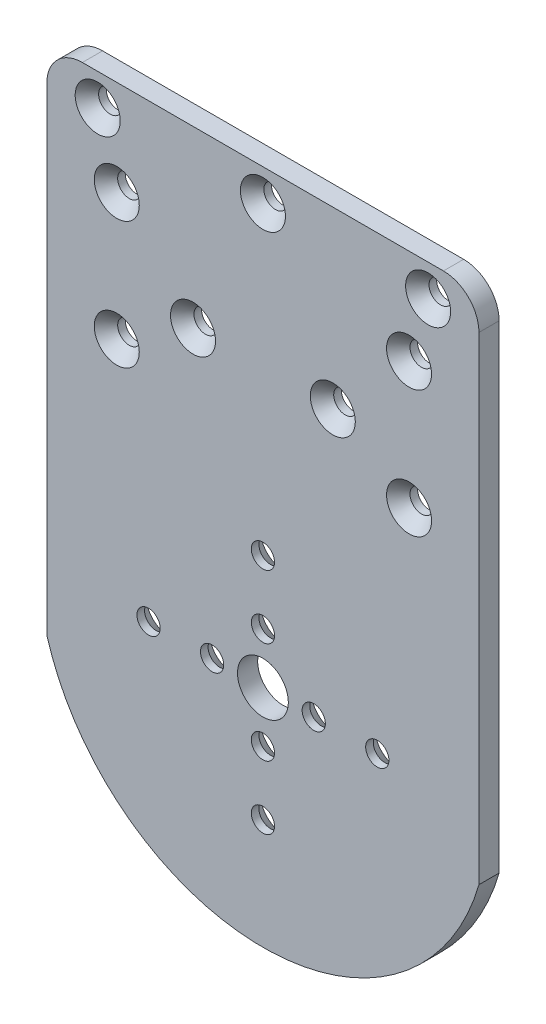
ISO-10303-21;
HEADER;
FILE_DESCRIPTION(('STEP AP214'),'2;1');
FILE_NAME('part.step','',(''),(''),'','','');
FILE_SCHEMA(('AUTOMOTIVE_DESIGN { 1 0 10303 214 1 1 1 1 }'));
ENDSEC;
DATA;
#1=APPLICATION_CONTEXT('core data for automotive mechanical design processes');
#2=APPLICATION_PROTOCOL_DEFINITION('international standard','automotive_design',2000,#1);
#3=PRODUCT_CONTEXT('',#1,'mechanical');
#4=PRODUCT('Part','Part','',(#3));
#5=PRODUCT_RELATED_PRODUCT_CATEGORY('part','',(#4));
#6=PRODUCT_DEFINITION_FORMATION('','',#4);
#7=PRODUCT_DEFINITION_CONTEXT('part definition',#1,'design');
#8=PRODUCT_DEFINITION('design','',#6,#7);
#9=PRODUCT_DEFINITION_SHAPE('','',#8);
#10=(LENGTH_UNIT() NAMED_UNIT(*) SI_UNIT(.MILLI.,.METRE.));
#11=(NAMED_UNIT(*) PLANE_ANGLE_UNIT() SI_UNIT($,.RADIAN.));
#12=(NAMED_UNIT(*) SI_UNIT($,.STERADIAN.) SOLID_ANGLE_UNIT());
#13=UNCERTAINTY_MEASURE_WITH_UNIT(LENGTH_MEASURE(1.E-05),#10,'distance_accuracy_value','');
#14=(GEOMETRIC_REPRESENTATION_CONTEXT(3) GLOBAL_UNCERTAINTY_ASSIGNED_CONTEXT((#13)) GLOBAL_UNIT_ASSIGNED_CONTEXT((#10,
#11,#12)) REPRESENTATION_CONTEXT('',''));
#15=CARTESIAN_POINT('',(0.,0.,0.));
#16=DIRECTION('',(0.,0.,1.));
#17=DIRECTION('',(1.,0.,0.));
#18=AXIS2_PLACEMENT_3D('',#15,#16,#17);
#19=CARTESIAN_POINT('',(0.,0.,3.175));
#20=DIRECTION('',(0.,0.,1.));
#21=DIRECTION('',(1.,0.,0.));
#22=AXIS2_PLACEMENT_3D('',#19,#20,#21);
#23=PLANE('',#22);
#24=CARTESIAN_POINT('',(23.,36.,3.175));
#25=DIRECTION('',(0.,0.,1.));
#26=DIRECTION('',(1.,0.,0.));
#27=AXIS2_PLACEMENT_3D('',#24,#25,#26);
#28=CIRCLE('',#27,3.5433);
#29=CARTESIAN_POINT('',(26.5433,36.,3.175));
#30=VERTEX_POINT('',#29);
#31=EDGE_CURVE('E304',#30,#30,#28,.T.);
#32=ORIENTED_EDGE('',*,*,#31,.F.);
#33=EDGE_LOOP('',(#32));
#34=FACE_BOUND('',#33,.T.);
#35=CARTESIAN_POINT('',(23.,56.,3.175));
#36=DIRECTION('',(0.,0.,1.));
#37=DIRECTION('',(1.,0.,0.));
#38=AXIS2_PLACEMENT_3D('',#35,#36,#37);
#39=CIRCLE('',#38,3.5433);
#40=CARTESIAN_POINT('',(26.5433,56.,3.175));
#41=VERTEX_POINT('',#40);
#42=EDGE_CURVE('E295',#41,#41,#39,.T.);
#43=ORIENTED_EDGE('',*,*,#42,.F.);
#44=EDGE_LOOP('',(#43));
#45=FACE_BOUND('',#44,.T.);
#46=CARTESIAN_POINT('',(0.,66.,3.175));
#47=DIRECTION('',(0.,0.,1.));
#48=DIRECTION('',(1.,0.,0.));
#49=AXIS2_PLACEMENT_3D('',#46,#47,#48);
#50=CIRCLE('',#49,3.5433);
#51=CARTESIAN_POINT('',(3.54330000000004,66.,3.175));
#52=VERTEX_POINT('',#51);
#53=EDGE_CURVE('E286',#52,#52,#50,.T.);
#54=ORIENTED_EDGE('',*,*,#53,.F.);
#55=EDGE_LOOP('',(#54));
#56=FACE_BOUND('',#55,.T.);
#57=CARTESIAN_POINT('',(-11.,43.5,3.175));
#58=DIRECTION('',(0.,0.,1.));
#59=DIRECTION('',(1.,0.,0.));
#60=AXIS2_PLACEMENT_3D('',#57,#58,#59);
#61=CIRCLE('',#60,3.5433);
#62=CARTESIAN_POINT('',(-7.4567,43.5,3.175));
#63=VERTEX_POINT('',#62);
#64=EDGE_CURVE('E277',#63,#63,#61,.T.);
#65=ORIENTED_EDGE('',*,*,#64,.F.);
#66=EDGE_LOOP('',(#65));
#67=FACE_BOUND('',#66,.T.);
#68=CARTESIAN_POINT('',(-23.,36.,3.175));
#69=DIRECTION('',(0.,0.,1.));
#70=DIRECTION('',(1.,0.,0.));
#71=AXIS2_PLACEMENT_3D('',#68,#69,#70);
#72=CIRCLE('',#71,3.5433);
#73=CARTESIAN_POINT('',(-19.4567,36.,3.175));
#74=VERTEX_POINT('',#73);
#75=EDGE_CURVE('E268',#74,#74,#72,.T.);
#76=ORIENTED_EDGE('',*,*,#75,.F.);
#77=EDGE_LOOP('',(#76));
#78=FACE_BOUND('',#77,.T.);
#79=CARTESIAN_POINT('',(-23.,56.,3.175));
#80=DIRECTION('',(0.,0.,1.));
#81=DIRECTION('',(1.,0.,0.));
#82=AXIS2_PLACEMENT_3D('',#79,#80,#81);
#83=CIRCLE('',#82,3.5433);
#84=CARTESIAN_POINT('',(-19.4567,56.,3.175));
#85=VERTEX_POINT('',#84);
#86=EDGE_CURVE('E259',#85,#85,#83,.T.);
#87=ORIENTED_EDGE('',*,*,#86,.F.);
#88=EDGE_LOOP('',(#87));
#89=FACE_BOUND('',#88,.T.);
#90=CARTESIAN_POINT('',(-26.,66.,3.175));
#91=DIRECTION('',(0.,0.,1.));
#92=DIRECTION('',(1.,0.,0.));
#93=AXIS2_PLACEMENT_3D('',#90,#91,#92);
#94=CIRCLE('',#93,3.5433);
#95=CARTESIAN_POINT('',(-22.4567,66.,3.175));
#96=VERTEX_POINT('',#95);
#97=EDGE_CURVE('E250',#96,#96,#94,.T.);
#98=ORIENTED_EDGE('',*,*,#97,.F.);
#99=EDGE_LOOP('',(#98));
#100=FACE_BOUND('',#99,.T.);
#101=CARTESIAN_POINT('',(26.,66.,3.175));
#102=DIRECTION('',(0.,0.,1.));
#103=DIRECTION('',(1.,0.,0.));
#104=AXIS2_PLACEMENT_3D('',#101,#102,#103);
#105=CIRCLE('',#104,3.5433);
#106=CARTESIAN_POINT('',(29.5433,66.,3.175));
#107=VERTEX_POINT('',#106);
#108=EDGE_CURVE('E241',#107,#107,#105,.T.);
#109=ORIENTED_EDGE('',*,*,#108,.F.);
#110=EDGE_LOOP('',(#109));
#111=FACE_BOUND('',#110,.T.);
#112=CARTESIAN_POINT('',(11.,43.5,3.175));
#113=DIRECTION('',(0.,0.,1.));
#114=DIRECTION('',(1.,0.,0.));
#115=AXIS2_PLACEMENT_3D('',#112,#113,#114);
#116=CIRCLE('',#115,3.5433);
#117=CARTESIAN_POINT('',(14.5433,43.5,3.175));
#118=VERTEX_POINT('',#117);
#119=EDGE_CURVE('E232',#118,#118,#116,.T.);
#120=ORIENTED_EDGE('',*,*,#119,.F.);
#121=EDGE_LOOP('',(#120));
#122=FACE_BOUND('',#121,.T.);
#123=CARTESIAN_POINT('',(0.,7.99999999999999,3.175));
#124=DIRECTION('',(0.,0.,-1.));
#125=DIRECTION('',(-1.,0.,0.));
#126=AXIS2_PLACEMENT_3D('',#123,#124,#125);
#127=CIRCLE('',#126,1.8288);
#128=CARTESIAN_POINT('',(-1.8288,7.99999999999999,3.175));
#129=VERTEX_POINT('',#128);
#130=EDGE_CURVE('E217',#129,#129,#127,.T.);
#131=ORIENTED_EDGE('',*,*,#130,.T.);
#132=EDGE_LOOP('',(#131));
#133=FACE_BOUND('',#132,.T.);
#134=CARTESIAN_POINT('',(0.,-7.99999999999999,3.175));
#135=DIRECTION('',(0.,0.,-1.));
#136=DIRECTION('',(-1.,0.,0.));
#137=AXIS2_PLACEMENT_3D('',#134,#135,#136);
#138=CIRCLE('',#137,1.8288);
#139=CARTESIAN_POINT('',(-1.8288,-7.99999999999999,3.175));
#140=VERTEX_POINT('',#139);
#141=EDGE_CURVE('E208',#140,#140,#138,.T.);
#142=ORIENTED_EDGE('',*,*,#141,.T.);
#143=EDGE_LOOP('',(#142));
#144=FACE_BOUND('',#143,.T.);
#145=CARTESIAN_POINT('',(7.99999999999999,0.,3.175));
#146=DIRECTION('',(0.,0.,-1.));
#147=DIRECTION('',(-1.,0.,0.));
#148=AXIS2_PLACEMENT_3D('',#145,#146,#147);
#149=CIRCLE('',#148,1.8288);
#150=CARTESIAN_POINT('',(6.17119999999999,0.,3.175));
#151=VERTEX_POINT('',#150);
#152=EDGE_CURVE('E199',#151,#151,#149,.T.);
#153=ORIENTED_EDGE('',*,*,#152,.T.);
#154=EDGE_LOOP('',(#153));
#155=FACE_BOUND('',#154,.T.);
#156=CARTESIAN_POINT('',(-7.99999999999999,0.,3.175));
#157=DIRECTION('',(0.,0.,-1.));
#158=DIRECTION('',(-1.,0.,0.));
#159=AXIS2_PLACEMENT_3D('',#156,#157,#158);
#160=CIRCLE('',#159,1.8288);
#161=CARTESIAN_POINT('',(-9.82879999999999,0.,3.175));
#162=VERTEX_POINT('',#161);
#163=EDGE_CURVE('E190',#162,#162,#160,.T.);
#164=ORIENTED_EDGE('',*,*,#163,.T.);
#165=EDGE_LOOP('',(#164));
#166=FACE_BOUND('',#165,.T.);
#167=CARTESIAN_POINT('',(18.,0.,3.175));
#168=DIRECTION('',(0.,0.,-1.));
#169=DIRECTION('',(-1.,0.,0.));
#170=AXIS2_PLACEMENT_3D('',#167,#168,#169);
#171=CIRCLE('',#170,1.8288);
#172=CARTESIAN_POINT('',(16.1712,0.,3.175));
#173=VERTEX_POINT('',#172);
#174=EDGE_CURVE('E181',#173,#173,#171,.T.);
#175=ORIENTED_EDGE('',*,*,#174,.T.);
#176=EDGE_LOOP('',(#175));
#177=FACE_BOUND('',#176,.T.);
#178=CARTESIAN_POINT('',(0.,-18.,3.175));
#179=DIRECTION('',(0.,0.,-1.));
#180=DIRECTION('',(-1.,0.,0.));
#181=AXIS2_PLACEMENT_3D('',#178,#179,#180);
#182=CIRCLE('',#181,1.8288);
#183=CARTESIAN_POINT('',(-1.8288,-18.,3.175));
#184=VERTEX_POINT('',#183);
#185=EDGE_CURVE('E172',#184,#184,#182,.T.);
#186=ORIENTED_EDGE('',*,*,#185,.T.);
#187=EDGE_LOOP('',(#186));
#188=FACE_BOUND('',#187,.T.);
#189=CARTESIAN_POINT('',(-18.,0.,3.175));
#190=DIRECTION('',(0.,0.,-1.));
#191=DIRECTION('',(-1.,0.,0.));
#192=AXIS2_PLACEMENT_3D('',#189,#190,#191);
#193=CIRCLE('',#192,1.8288);
#194=CARTESIAN_POINT('',(-19.8288,0.,3.175));
#195=VERTEX_POINT('',#194);
#196=EDGE_CURVE('E163',#195,#195,#193,.T.);
#197=ORIENTED_EDGE('',*,*,#196,.T.);
#198=EDGE_LOOP('',(#197));
#199=FACE_BOUND('',#198,.T.);
#200=CARTESIAN_POINT('',(0.,18.,3.175));
#201=DIRECTION('',(0.,0.,-1.));
#202=DIRECTION('',(-1.,0.,0.));
#203=AXIS2_PLACEMENT_3D('',#200,#201,#202);
#204=CIRCLE('',#203,1.8288);
#205=CARTESIAN_POINT('',(-1.8288,18.,3.175));
#206=VERTEX_POINT('',#205);
#207=EDGE_CURVE('E152',#206,#206,#204,.T.);
#208=ORIENTED_EDGE('',*,*,#207,.T.);
#209=EDGE_LOOP('',(#208));
#210=FACE_BOUND('',#209,.T.);
#211=DIRECTION('',(-1.,0.,0.));
#212=VECTOR('',#211,1.);
#213=CARTESIAN_POINT('',(-34.,71.,3.175));
#214=LINE('',#213,#212);
#215=CARTESIAN_POINT('',(28.412,71.,3.175));
#216=VERTEX_POINT('',#215);
#217=CARTESIAN_POINT('',(-28.412,71.,3.175));
#218=VERTEX_POINT('',#217);
#219=EDGE_CURVE('E95',#216,#218,#214,.T.);
#220=ORIENTED_EDGE('',*,*,#219,.T.);
#221=CARTESIAN_POINT('',(-28.412,65.412,3.175));
#222=DIRECTION('',(0.,0.,1.));
#223=DIRECTION('',(1.,0.,0.));
#224=AXIS2_PLACEMENT_3D('',#221,#222,#223);
#225=CIRCLE('',#224,5.588);
#226=CARTESIAN_POINT('',(-34.,65.412,3.175));
#227=VERTEX_POINT('',#226);
#228=EDGE_CURVE('E43',#218,#227,#225,.T.);
#229=ORIENTED_EDGE('',*,*,#228,.T.);
#230=DIRECTION('',(0.,-1.,0.));
#231=VECTOR('',#230,1.);
#232=CARTESIAN_POINT('',(-34.,71.,3.175));
#233=LINE('',#232,#231);
#234=CARTESIAN_POINT('',(-34.,-9.85697722428144,3.175));
#235=VERTEX_POINT('',#234);
#236=EDGE_CURVE('E101',#227,#235,#233,.T.);
#237=ORIENTED_EDGE('',*,*,#236,.T.);
#238=CARTESIAN_POINT('',(0.,0.,3.175));
#239=DIRECTION('',(0.,0.,1.));
#240=DIRECTION('',(1.,0.,0.));
#241=AXIS2_PLACEMENT_3D('',#238,#239,#240);
#242=CIRCLE('',#241,35.4);
#243=CARTESIAN_POINT('',(34.,-9.85697722428144,3.175));
#244=VERTEX_POINT('',#243);
#245=EDGE_CURVE('E96',#235,#244,#242,.T.);
#246=ORIENTED_EDGE('',*,*,#245,.T.);
#247=DIRECTION('',(0.,1.,0.));
#248=VECTOR('',#247,1.);
#249=CARTESIAN_POINT('',(34.,71.,3.175));
#250=LINE('',#249,#248);
#251=CARTESIAN_POINT('',(34.,65.412,3.175));
#252=VERTEX_POINT('',#251);
#253=EDGE_CURVE('E87',#244,#252,#250,.T.);
#254=ORIENTED_EDGE('',*,*,#253,.T.);
#255=CARTESIAN_POINT('',(28.412,65.412,3.175));
#256=DIRECTION('',(0.,0.,1.));
#257=DIRECTION('',(1.,0.,0.));
#258=AXIS2_PLACEMENT_3D('',#255,#256,#257);
#259=CIRCLE('',#258,5.588);
#260=EDGE_CURVE('E126',#252,#216,#259,.T.);
#261=ORIENTED_EDGE('',*,*,#260,.T.);
#262=EDGE_LOOP('',(#220,#229,#237,#246,#254,#261));
#263=FACE_BOUND('',#262,.T.);
#264=CARTESIAN_POINT('',(0.,0.,3.175));
#265=DIRECTION('',(0.,0.,1.));
#266=DIRECTION('',(1.,0.,0.));
#267=AXIS2_PLACEMENT_3D('',#264,#265,#266);
#268=CIRCLE('',#267,4.);
#269=CARTESIAN_POINT('',(4.,0.,3.175));
#270=VERTEX_POINT('',#269);
#271=EDGE_CURVE('E146',#270,#270,#268,.T.);
#272=ORIENTED_EDGE('',*,*,#271,.F.);
#273=EDGE_LOOP('',(#272));
#274=FACE_BOUND('',#273,.T.);
#275=ADVANCED_FACE('F35',(#34,#45,#56,#67,#78,#89,#100,#111,#122,#133,#144,#155,#166,#177,#188,
#199,#210,#263,#274),#23,.T.);
#276=CARTESIAN_POINT('',(0.,0.,0.));
#277=DIRECTION('',(0.,0.,1.));
#278=DIRECTION('',(1.,0.,0.));
#279=AXIS2_PLACEMENT_3D('',#276,#277,#278);
#280=PLANE('',#279);
#281=CARTESIAN_POINT('',(23.,36.,0.));
#282=DIRECTION('',(0.,0.,1.));
#283=DIRECTION('',(1.,0.,0.));
#284=AXIS2_PLACEMENT_3D('',#281,#282,#283);
#285=CIRCLE('',#284,1.8288);
#286=CARTESIAN_POINT('',(24.8288,36.,0.));
#287=VERTEX_POINT('',#286);
#288=EDGE_CURVE('E298',#287,#287,#285,.T.);
#289=ORIENTED_EDGE('',*,*,#288,.T.);
#290=EDGE_LOOP('',(#289));
#291=FACE_BOUND('',#290,.T.);
#292=CARTESIAN_POINT('',(23.,56.,0.));
#293=DIRECTION('',(0.,0.,1.));
#294=DIRECTION('',(1.,0.,0.));
#295=AXIS2_PLACEMENT_3D('',#292,#293,#294);
#296=CIRCLE('',#295,1.8288);
#297=CARTESIAN_POINT('',(24.8288,56.,0.));
#298=VERTEX_POINT('',#297);
#299=EDGE_CURVE('E289',#298,#298,#296,.T.);
#300=ORIENTED_EDGE('',*,*,#299,.T.);
#301=EDGE_LOOP('',(#300));
#302=FACE_BOUND('',#301,.T.);
#303=CARTESIAN_POINT('',(0.,66.,0.));
#304=DIRECTION('',(0.,0.,1.));
#305=DIRECTION('',(1.,0.,0.));
#306=AXIS2_PLACEMENT_3D('',#303,#304,#305);
#307=CIRCLE('',#306,1.8288);
#308=CARTESIAN_POINT('',(1.82880000000004,66.,0.));
#309=VERTEX_POINT('',#308);
#310=EDGE_CURVE('E280',#309,#309,#307,.T.);
#311=ORIENTED_EDGE('',*,*,#310,.T.);
#312=EDGE_LOOP('',(#311));
#313=FACE_BOUND('',#312,.T.);
#314=CARTESIAN_POINT('',(-11.,43.5,0.));
#315=DIRECTION('',(0.,0.,1.));
#316=DIRECTION('',(1.,0.,0.));
#317=AXIS2_PLACEMENT_3D('',#314,#315,#316);
#318=CIRCLE('',#317,1.8288);
#319=CARTESIAN_POINT('',(-9.1712,43.5,0.));
#320=VERTEX_POINT('',#319);
#321=EDGE_CURVE('E271',#320,#320,#318,.T.);
#322=ORIENTED_EDGE('',*,*,#321,.T.);
#323=EDGE_LOOP('',(#322));
#324=FACE_BOUND('',#323,.T.);
#325=CARTESIAN_POINT('',(-23.,36.,0.));
#326=DIRECTION('',(0.,0.,1.));
#327=DIRECTION('',(1.,0.,0.));
#328=AXIS2_PLACEMENT_3D('',#325,#326,#327);
#329=CIRCLE('',#328,1.8288);
#330=CARTESIAN_POINT('',(-21.1712,36.,0.));
#331=VERTEX_POINT('',#330);
#332=EDGE_CURVE('E262',#331,#331,#329,.T.);
#333=ORIENTED_EDGE('',*,*,#332,.T.);
#334=EDGE_LOOP('',(#333));
#335=FACE_BOUND('',#334,.T.);
#336=CARTESIAN_POINT('',(-23.,56.,0.));
#337=DIRECTION('',(0.,0.,1.));
#338=DIRECTION('',(1.,0.,0.));
#339=AXIS2_PLACEMENT_3D('',#336,#337,#338);
#340=CIRCLE('',#339,1.8288);
#341=CARTESIAN_POINT('',(-21.1712,56.,0.));
#342=VERTEX_POINT('',#341);
#343=EDGE_CURVE('E253',#342,#342,#340,.T.);
#344=ORIENTED_EDGE('',*,*,#343,.T.);
#345=EDGE_LOOP('',(#344));
#346=FACE_BOUND('',#345,.T.);
#347=CARTESIAN_POINT('',(-26.,66.,0.));
#348=DIRECTION('',(0.,0.,1.));
#349=DIRECTION('',(1.,0.,0.));
#350=AXIS2_PLACEMENT_3D('',#347,#348,#349);
#351=CIRCLE('',#350,1.8288);
#352=CARTESIAN_POINT('',(-24.1712,66.,0.));
#353=VERTEX_POINT('',#352);
#354=EDGE_CURVE('E244',#353,#353,#351,.T.);
#355=ORIENTED_EDGE('',*,*,#354,.T.);
#356=EDGE_LOOP('',(#355));
#357=FACE_BOUND('',#356,.T.);
#358=CARTESIAN_POINT('',(26.,66.,0.));
#359=DIRECTION('',(0.,0.,1.));
#360=DIRECTION('',(1.,0.,0.));
#361=AXIS2_PLACEMENT_3D('',#358,#359,#360);
#362=CIRCLE('',#361,1.8288);
#363=CARTESIAN_POINT('',(27.8288,66.,0.));
#364=VERTEX_POINT('',#363);
#365=EDGE_CURVE('E235',#364,#364,#362,.T.);
#366=ORIENTED_EDGE('',*,*,#365,.T.);
#367=EDGE_LOOP('',(#366));
#368=FACE_BOUND('',#367,.T.);
#369=CARTESIAN_POINT('',(11.,43.5,0.));
#370=DIRECTION('',(0.,0.,1.));
#371=DIRECTION('',(1.,0.,0.));
#372=AXIS2_PLACEMENT_3D('',#369,#370,#371);
#373=CIRCLE('',#372,1.8288);
#374=CARTESIAN_POINT('',(12.8288,43.5,0.));
#375=VERTEX_POINT('',#374);
#376=EDGE_CURVE('E226',#375,#375,#373,.T.);
#377=ORIENTED_EDGE('',*,*,#376,.T.);
#378=EDGE_LOOP('',(#377));
#379=FACE_BOUND('',#378,.T.);
#380=CARTESIAN_POINT('',(0.,7.99999999999999,0.));
#381=DIRECTION('',(0.,0.,-1.));
#382=DIRECTION('',(-1.,0.,0.));
#383=AXIS2_PLACEMENT_3D('',#380,#381,#382);
#384=CIRCLE('',#383,3.5433);
#385=CARTESIAN_POINT('',(-3.5433,7.99999999999999,0.));
#386=VERTEX_POINT('',#385);
#387=EDGE_CURVE('E223',#386,#386,#384,.T.);
#388=ORIENTED_EDGE('',*,*,#387,.F.);
#389=EDGE_LOOP('',(#388));
#390=FACE_BOUND('',#389,.T.);
#391=CARTESIAN_POINT('',(0.,-7.99999999999999,0.));
#392=DIRECTION('',(0.,0.,-1.));
#393=DIRECTION('',(-1.,0.,0.));
#394=AXIS2_PLACEMENT_3D('',#391,#392,#393);
#395=CIRCLE('',#394,3.5433);
#396=CARTESIAN_POINT('',(-3.5433,-7.99999999999999,0.));
#397=VERTEX_POINT('',#396);
#398=EDGE_CURVE('E214',#397,#397,#395,.T.);
#399=ORIENTED_EDGE('',*,*,#398,.F.);
#400=EDGE_LOOP('',(#399));
#401=FACE_BOUND('',#400,.T.);
#402=CARTESIAN_POINT('',(7.99999999999999,0.,0.));
#403=DIRECTION('',(0.,0.,-1.));
#404=DIRECTION('',(-1.,0.,0.));
#405=AXIS2_PLACEMENT_3D('',#402,#403,#404);
#406=CIRCLE('',#405,3.5433);
#407=CARTESIAN_POINT('',(4.45669999999999,0.,0.));
#408=VERTEX_POINT('',#407);
#409=EDGE_CURVE('E205',#408,#408,#406,.T.);
#410=ORIENTED_EDGE('',*,*,#409,.F.);
#411=EDGE_LOOP('',(#410));
#412=FACE_BOUND('',#411,.T.);
#413=CARTESIAN_POINT('',(-7.99999999999999,0.,0.));
#414=DIRECTION('',(0.,0.,-1.));
#415=DIRECTION('',(-1.,0.,0.));
#416=AXIS2_PLACEMENT_3D('',#413,#414,#415);
#417=CIRCLE('',#416,3.5433);
#418=CARTESIAN_POINT('',(-11.5433,0.,0.));
#419=VERTEX_POINT('',#418);
#420=EDGE_CURVE('E196',#419,#419,#417,.T.);
#421=ORIENTED_EDGE('',*,*,#420,.F.);
#422=EDGE_LOOP('',(#421));
#423=FACE_BOUND('',#422,.T.);
#424=CARTESIAN_POINT('',(18.,0.,0.));
#425=DIRECTION('',(0.,0.,-1.));
#426=DIRECTION('',(-1.,0.,0.));
#427=AXIS2_PLACEMENT_3D('',#424,#425,#426);
#428=CIRCLE('',#427,3.5433);
#429=CARTESIAN_POINT('',(14.4567,0.,0.));
#430=VERTEX_POINT('',#429);
#431=EDGE_CURVE('E187',#430,#430,#428,.T.);
#432=ORIENTED_EDGE('',*,*,#431,.F.);
#433=EDGE_LOOP('',(#432));
#434=FACE_BOUND('',#433,.T.);
#435=CARTESIAN_POINT('',(0.,-18.,0.));
#436=DIRECTION('',(0.,0.,-1.));
#437=DIRECTION('',(-1.,0.,0.));
#438=AXIS2_PLACEMENT_3D('',#435,#436,#437);
#439=CIRCLE('',#438,3.5433);
#440=CARTESIAN_POINT('',(-3.5433,-18.,0.));
#441=VERTEX_POINT('',#440);
#442=EDGE_CURVE('E178',#441,#441,#439,.T.);
#443=ORIENTED_EDGE('',*,*,#442,.F.);
#444=EDGE_LOOP('',(#443));
#445=FACE_BOUND('',#444,.T.);
#446=CARTESIAN_POINT('',(-18.,0.,0.));
#447=DIRECTION('',(0.,0.,-1.));
#448=DIRECTION('',(-1.,0.,0.));
#449=AXIS2_PLACEMENT_3D('',#446,#447,#448);
#450=CIRCLE('',#449,3.5433);
#451=CARTESIAN_POINT('',(-21.5433,0.,0.));
#452=VERTEX_POINT('',#451);
#453=EDGE_CURVE('E169',#452,#452,#450,.T.);
#454=ORIENTED_EDGE('',*,*,#453,.F.);
#455=EDGE_LOOP('',(#454));
#456=FACE_BOUND('',#455,.T.);
#457=CARTESIAN_POINT('',(0.,18.,0.));
#458=DIRECTION('',(0.,0.,-1.));
#459=DIRECTION('',(-1.,0.,0.));
#460=AXIS2_PLACEMENT_3D('',#457,#458,#459);
#461=CIRCLE('',#460,3.5433);
#462=CARTESIAN_POINT('',(-3.5433,18.,0.));
#463=VERTEX_POINT('',#462);
#464=EDGE_CURVE('E160',#463,#463,#461,.T.);
#465=ORIENTED_EDGE('',*,*,#464,.F.);
#466=EDGE_LOOP('',(#465));
#467=FACE_BOUND('',#466,.T.);
#468=DIRECTION('',(0.,-1.,0.));
#469=VECTOR('',#468,1.);
#470=CARTESIAN_POINT('',(-34.,71.,0.));
#471=LINE('',#470,#469);
#472=CARTESIAN_POINT('',(-34.,65.412,0.));
#473=VERTEX_POINT('',#472);
#474=CARTESIAN_POINT('',(-34.,-9.85697722428144,0.));
#475=VERTEX_POINT('',#474);
#476=EDGE_CURVE('E105',#473,#475,#471,.T.);
#477=ORIENTED_EDGE('',*,*,#476,.F.);
#478=CARTESIAN_POINT('',(-28.412,65.412,0.));
#479=DIRECTION('',(0.,0.,1.));
#480=DIRECTION('',(1.,0.,0.));
#481=AXIS2_PLACEMENT_3D('',#478,#479,#480);
#482=CIRCLE('',#481,5.588);
#483=CARTESIAN_POINT('',(-28.412,71.,0.));
#484=VERTEX_POINT('',#483);
#485=EDGE_CURVE('E120',#473,#484,#482,.F.);
#486=ORIENTED_EDGE('',*,*,#485,.T.);
#487=DIRECTION('',(-1.,0.,0.));
#488=VECTOR('',#487,1.);
#489=CARTESIAN_POINT('',(-34.,71.,0.));
#490=LINE('',#489,#488);
#491=CARTESIAN_POINT('',(28.412,71.,0.));
#492=VERTEX_POINT('',#491);
#493=EDGE_CURVE('E139',#492,#484,#490,.T.);
#494=ORIENTED_EDGE('',*,*,#493,.F.);
#495=CARTESIAN_POINT('',(28.412,65.412,0.));
#496=DIRECTION('',(0.,0.,1.));
#497=DIRECTION('',(1.,0.,0.));
#498=AXIS2_PLACEMENT_3D('',#495,#496,#497);
#499=CIRCLE('',#498,5.588);
#500=CARTESIAN_POINT('',(34.,65.412,0.));
#501=VERTEX_POINT('',#500);
#502=EDGE_CURVE('E114',#492,#501,#499,.F.);
#503=ORIENTED_EDGE('',*,*,#502,.T.);
#504=DIRECTION('',(0.,1.,0.));
#505=VECTOR('',#504,1.);
#506=CARTESIAN_POINT('',(34.,71.,0.));
#507=LINE('',#506,#505);
#508=CARTESIAN_POINT('',(34.,-9.85697722428144,0.));
#509=VERTEX_POINT('',#508);
#510=EDGE_CURVE('E142',#509,#501,#507,.T.);
#511=ORIENTED_EDGE('',*,*,#510,.F.);
#512=CARTESIAN_POINT('',(0.,0.,0.));
#513=DIRECTION('',(0.,0.,1.));
#514=DIRECTION('',(1.,0.,0.));
#515=AXIS2_PLACEMENT_3D('',#512,#513,#514);
#516=CIRCLE('',#515,35.4);
#517=EDGE_CURVE('E109',#475,#509,#516,.T.);
#518=ORIENTED_EDGE('',*,*,#517,.F.);
#519=EDGE_LOOP('',(#477,#486,#494,#503,#511,#518));
#520=FACE_BOUND('',#519,.T.);
#521=CARTESIAN_POINT('',(0.,0.,0.));
#522=DIRECTION('',(0.,0.,1.));
#523=DIRECTION('',(1.,0.,0.));
#524=AXIS2_PLACEMENT_3D('',#521,#522,#523);
#525=CIRCLE('',#524,4.);
#526=CARTESIAN_POINT('',(4.,0.,0.));
#527=VERTEX_POINT('',#526);
#528=EDGE_CURVE('E149',#527,#527,#525,.T.);
#529=ORIENTED_EDGE('',*,*,#528,.T.);
#530=EDGE_LOOP('',(#529));
#531=FACE_BOUND('',#530,.T.);
#532=ADVANCED_FACE('F137',(#291,#302,#313,#324,#335,#346,#357,#368,#379,#390,#401,#412,#423,
#434,#445,#456,#467,#520,#531),#280,.F.);
#533=CARTESIAN_POINT('',(0.,0.,3.175));
#534=DIRECTION('',(0.,0.,-1.));
#535=DIRECTION('',(-1.,0.,0.));
#536=AXIS2_PLACEMENT_3D('',#533,#534,#535);
#537=CYLINDRICAL_SURFACE('',#536,35.4);
#538=ORIENTED_EDGE('',*,*,#517,.T.);
#539=DIRECTION('',(0.,0.,-1.));
#540=VECTOR('',#539,1.);
#541=CARTESIAN_POINT('',(34.,-9.85697722428144,3.175));
#542=LINE('',#541,#540);
#543=EDGE_CURVE('E91',#244,#509,#542,.T.);
#544=ORIENTED_EDGE('',*,*,#543,.F.);
#545=ORIENTED_EDGE('',*,*,#245,.F.);
#546=DIRECTION('',(0.,0.,-1.));
#547=VECTOR('',#546,1.);
#548=CARTESIAN_POINT('',(-34.,-9.85697722428144,3.175));
#549=LINE('',#548,#547);
#550=EDGE_CURVE('E111',#235,#475,#549,.T.);
#551=ORIENTED_EDGE('',*,*,#550,.T.);
#552=EDGE_LOOP('',(#538,#544,#545,#551));
#553=FACE_BOUND('',#552,.T.);
#554=ADVANCED_FACE('F107',(#553),#537,.T.);
#555=CARTESIAN_POINT('',(34.,71.,3.175));
#556=DIRECTION('',(-1.,0.,0.));
#557=DIRECTION('',(0.,-1.,0.));
#558=AXIS2_PLACEMENT_3D('',#555,#556,#557);
#559=PLANE('',#558);
#560=ORIENTED_EDGE('',*,*,#510,.T.);
#561=DIRECTION('',(0.,0.,-1.));
#562=VECTOR('',#561,1.);
#563=CARTESIAN_POINT('',(34.,65.412,3.175));
#564=LINE('',#563,#562);
#565=EDGE_CURVE('E11',#501,#252,#564,.F.);
#566=ORIENTED_EDGE('',*,*,#565,.T.);
#567=ORIENTED_EDGE('',*,*,#253,.F.);
#568=ORIENTED_EDGE('',*,*,#543,.T.);
#569=EDGE_LOOP('',(#560,#566,#567,#568));
#570=FACE_BOUND('',#569,.T.);
#571=ADVANCED_FACE('F89',(#570),#559,.F.);
#572=CARTESIAN_POINT('',(-34.,71.,3.175));
#573=DIRECTION('',(0.,-1.,0.));
#574=DIRECTION('',(0.,0.,-1.));
#575=AXIS2_PLACEMENT_3D('',#572,#573,#574);
#576=PLANE('',#575);
#577=ORIENTED_EDGE('',*,*,#493,.T.);
#578=DIRECTION('',(0.,0.,-1.));
#579=VECTOR('',#578,1.);
#580=CARTESIAN_POINT('',(-28.412,71.,3.175));
#581=LINE('',#580,#579);
#582=EDGE_CURVE('E56',#484,#218,#581,.F.);
#583=ORIENTED_EDGE('',*,*,#582,.T.);
#584=ORIENTED_EDGE('',*,*,#219,.F.);
#585=DIRECTION('',(0.,0.,-1.));
#586=VECTOR('',#585,1.);
#587=CARTESIAN_POINT('',(28.412,71.,3.175));
#588=LINE('',#587,#586);
#589=EDGE_CURVE('E122',#216,#492,#588,.T.);
#590=ORIENTED_EDGE('',*,*,#589,.T.);
#591=EDGE_LOOP('',(#577,#583,#584,#590));
#592=FACE_BOUND('',#591,.T.);
#593=ADVANCED_FACE('F140',(#592),#576,.F.);
#594=CARTESIAN_POINT('',(-34.,71.,3.175));
#595=DIRECTION('',(1.,0.,0.));
#596=DIRECTION('',(0.,1.,0.));
#597=AXIS2_PLACEMENT_3D('',#594,#595,#596);
#598=PLANE('',#597);
#599=ORIENTED_EDGE('',*,*,#236,.F.);
#600=DIRECTION('',(0.,0.,-1.));
#601=VECTOR('',#600,1.);
#602=CARTESIAN_POINT('',(-34.,65.412,3.175));
#603=LINE('',#602,#601);
#604=EDGE_CURVE('E110',#227,#473,#603,.T.);
#605=ORIENTED_EDGE('',*,*,#604,.T.);
#606=ORIENTED_EDGE('',*,*,#476,.T.);
#607=ORIENTED_EDGE('',*,*,#550,.F.);
#608=EDGE_LOOP('',(#599,#605,#606,#607));
#609=FACE_BOUND('',#608,.T.);
#610=ADVANCED_FACE('F131',(#609),#598,.F.);
#611=CARTESIAN_POINT('',(0.,0.,3.175));
#612=DIRECTION('',(0.,0.,-1.));
#613=DIRECTION('',(-1.,0.,0.));
#614=AXIS2_PLACEMENT_3D('',#611,#612,#613);
#615=CYLINDRICAL_SURFACE('',#614,4.);
#616=ORIENTED_EDGE('',*,*,#271,.T.);
#617=EDGE_LOOP('',(#616));
#618=FACE_BOUND('',#617,.T.);
#619=ORIENTED_EDGE('',*,*,#528,.F.);
#620=EDGE_LOOP('',(#619));
#621=FACE_BOUND('',#620,.T.);
#622=ADVANCED_FACE('F370',(#618,#621),#615,.F.);
#623=CARTESIAN_POINT('',(-28.412,65.412,3.175));
#624=DIRECTION('',(0.,0.,-1.));
#625=DIRECTION('',(-1.,0.,0.));
#626=AXIS2_PLACEMENT_3D('',#623,#624,#625);
#627=CYLINDRICAL_SURFACE('',#626,5.588);
#628=ORIENTED_EDGE('',*,*,#228,.F.);
#629=ORIENTED_EDGE('',*,*,#582,.F.);
#630=ORIENTED_EDGE('',*,*,#485,.F.);
#631=ORIENTED_EDGE('',*,*,#604,.F.);
#632=EDGE_LOOP('',(#628,#629,#630,#631));
#633=FACE_BOUND('',#632,.T.);
#634=ADVANCED_FACE('F134',(#633),#627,.T.);
#635=CARTESIAN_POINT('',(28.412,65.412,3.175));
#636=DIRECTION('',(0.,0.,-1.));
#637=DIRECTION('',(-1.,0.,0.));
#638=AXIS2_PLACEMENT_3D('',#635,#636,#637);
#639=CYLINDRICAL_SURFACE('',#638,5.588);
#640=ORIENTED_EDGE('',*,*,#260,.F.);
#641=ORIENTED_EDGE('',*,*,#565,.F.);
#642=ORIENTED_EDGE('',*,*,#502,.F.);
#643=ORIENTED_EDGE('',*,*,#589,.F.);
#644=EDGE_LOOP('',(#640,#641,#642,#643));
#645=FACE_BOUND('',#644,.T.);
#646=ADVANCED_FACE('F37',(#645),#639,.T.);
#647=CARTESIAN_POINT('',(0.,18.,0.));
#648=DIRECTION('',(0.,0.,-1.));
#649=DIRECTION('',(-1.,0.,0.));
#650=AXIS2_PLACEMENT_3D('',#647,#648,#649);
#651=CYLINDRICAL_SURFACE('',#650,1.8288);
#652=ORIENTED_EDGE('',*,*,#207,.F.);
#653=EDGE_LOOP('',(#652));
#654=FACE_BOUND('',#653,.T.);
#655=CARTESIAN_POINT('',(0.,18.,1.97230663418042));
#656=DIRECTION('',(0.,0.,-1.));
#657=DIRECTION('',(-1.,0.,0.));
#658=AXIS2_PLACEMENT_3D('',#655,#656,#657);
#659=CIRCLE('',#658,1.8288);
#660=CARTESIAN_POINT('',(-1.8288,18.,1.97230663418042));
#661=VERTEX_POINT('',#660);
#662=EDGE_CURVE('E157',#661,#661,#659,.T.);
#663=ORIENTED_EDGE('',*,*,#662,.T.);
#664=EDGE_LOOP('',(#663));
#665=FACE_BOUND('',#664,.T.);
#666=ADVANCED_FACE('F345',(#654,#665),#651,.F.);
#667=CARTESIAN_POINT('',(0.,18.,0.));
#668=DIRECTION('',(0.,0.,-1.));
#669=DIRECTION('',(-1.,0.,0.));
#670=AXIS2_PLACEMENT_3D('',#667,#668,#669);
#671=CONICAL_SURFACE('',#670,3.5433,0.715584993317675);
#672=ORIENTED_EDGE('',*,*,#662,.F.);
#673=EDGE_LOOP('',(#672));
#674=FACE_BOUND('',#673,.T.);
#675=ORIENTED_EDGE('',*,*,#464,.T.);
#676=EDGE_LOOP('',(#675));
#677=FACE_BOUND('',#676,.T.);
#678=ADVANCED_FACE('F348',(#674,#677),#671,.F.);
#679=CARTESIAN_POINT('',(-18.,0.,0.));
#680=DIRECTION('',(0.,0.,-1.));
#681=DIRECTION('',(-1.,0.,0.));
#682=AXIS2_PLACEMENT_3D('',#679,#680,#681);
#683=CYLINDRICAL_SURFACE('',#682,1.8288);
#684=ORIENTED_EDGE('',*,*,#196,.F.);
#685=EDGE_LOOP('',(#684));
#686=FACE_BOUND('',#685,.T.);
#687=CARTESIAN_POINT('',(-18.,0.,1.97230663418042));
#688=DIRECTION('',(0.,0.,-1.));
#689=DIRECTION('',(-1.,0.,0.));
#690=AXIS2_PLACEMENT_3D('',#687,#688,#689);
#691=CIRCLE('',#690,1.8288);
#692=CARTESIAN_POINT('',(-19.8288,0.,1.97230663418042));
#693=VERTEX_POINT('',#692);
#694=EDGE_CURVE('E166',#693,#693,#691,.T.);
#695=ORIENTED_EDGE('',*,*,#694,.T.);
#696=EDGE_LOOP('',(#695));
#697=FACE_BOUND('',#696,.T.);
#698=ADVANCED_FACE('F354',(#686,#697),#683,.F.);
#699=CARTESIAN_POINT('',(-18.,0.,0.));
#700=DIRECTION('',(0.,0.,-1.));
#701=DIRECTION('',(-1.,0.,0.));
#702=AXIS2_PLACEMENT_3D('',#699,#700,#701);
#703=CONICAL_SURFACE('',#702,3.5433,0.715584993317675);
#704=ORIENTED_EDGE('',*,*,#694,.F.);
#705=EDGE_LOOP('',(#704));
#706=FACE_BOUND('',#705,.T.);
#707=ORIENTED_EDGE('',*,*,#453,.T.);
#708=EDGE_LOOP('',(#707));
#709=FACE_BOUND('',#708,.T.);
#710=ADVANCED_FACE('F387',(#706,#709),#703,.F.);
#711=CARTESIAN_POINT('',(0.,-18.,0.));
#712=DIRECTION('',(0.,0.,-1.));
#713=DIRECTION('',(-1.,0.,0.));
#714=AXIS2_PLACEMENT_3D('',#711,#712,#713);
#715=CYLINDRICAL_SURFACE('',#714,1.8288);
#716=ORIENTED_EDGE('',*,*,#185,.F.);
#717=EDGE_LOOP('',(#716));
#718=FACE_BOUND('',#717,.T.);
#719=CARTESIAN_POINT('',(0.,-18.,1.97230663418042));
#720=DIRECTION('',(0.,0.,-1.));
#721=DIRECTION('',(-1.,0.,0.));
#722=AXIS2_PLACEMENT_3D('',#719,#720,#721);
#723=CIRCLE('',#722,1.8288);
#724=CARTESIAN_POINT('',(-1.8288,-18.,1.97230663418042));
#725=VERTEX_POINT('',#724);
#726=EDGE_CURVE('E175',#725,#725,#723,.T.);
#727=ORIENTED_EDGE('',*,*,#726,.T.);
#728=EDGE_LOOP('',(#727));
#729=FACE_BOUND('',#728,.T.);
#730=ADVANCED_FACE('F391',(#718,#729),#715,.F.);
#731=CARTESIAN_POINT('',(0.,-18.,0.));
#732=DIRECTION('',(0.,0.,-1.));
#733=DIRECTION('',(-1.,0.,0.));
#734=AXIS2_PLACEMENT_3D('',#731,#732,#733);
#735=CONICAL_SURFACE('',#734,3.5433,0.715584993317675);
#736=ORIENTED_EDGE('',*,*,#726,.F.);
#737=EDGE_LOOP('',(#736));
#738=FACE_BOUND('',#737,.T.);
#739=ORIENTED_EDGE('',*,*,#442,.T.);
#740=EDGE_LOOP('',(#739));
#741=FACE_BOUND('',#740,.T.);
#742=ADVANCED_FACE('F395',(#738,#741),#735,.F.);
#743=CARTESIAN_POINT('',(18.,0.,0.));
#744=DIRECTION('',(0.,0.,-1.));
#745=DIRECTION('',(-1.,0.,0.));
#746=AXIS2_PLACEMENT_3D('',#743,#744,#745);
#747=CYLINDRICAL_SURFACE('',#746,1.8288);
#748=ORIENTED_EDGE('',*,*,#174,.F.);
#749=EDGE_LOOP('',(#748));
#750=FACE_BOUND('',#749,.T.);
#751=CARTESIAN_POINT('',(18.,0.,1.97230663418042));
#752=DIRECTION('',(0.,0.,-1.));
#753=DIRECTION('',(-1.,0.,0.));
#754=AXIS2_PLACEMENT_3D('',#751,#752,#753);
#755=CIRCLE('',#754,1.8288);
#756=CARTESIAN_POINT('',(16.1712,0.,1.97230663418042));
#757=VERTEX_POINT('',#756);
#758=EDGE_CURVE('E184',#757,#757,#755,.T.);
#759=ORIENTED_EDGE('',*,*,#758,.T.);
#760=EDGE_LOOP('',(#759));
#761=FACE_BOUND('',#760,.T.);
#762=ADVANCED_FACE('F399',(#750,#761),#747,.F.);
#763=CARTESIAN_POINT('',(18.,0.,0.));
#764=DIRECTION('',(0.,0.,-1.));
#765=DIRECTION('',(-1.,0.,0.));
#766=AXIS2_PLACEMENT_3D('',#763,#764,#765);
#767=CONICAL_SURFACE('',#766,3.5433,0.715584993317675);
#768=ORIENTED_EDGE('',*,*,#758,.F.);
#769=EDGE_LOOP('',(#768));
#770=FACE_BOUND('',#769,.T.);
#771=ORIENTED_EDGE('',*,*,#431,.T.);
#772=EDGE_LOOP('',(#771));
#773=FACE_BOUND('',#772,.T.);
#774=ADVANCED_FACE('F403',(#770,#773),#767,.F.);
#775=CARTESIAN_POINT('',(-7.99999999999999,0.,0.));
#776=DIRECTION('',(0.,0.,-1.));
#777=DIRECTION('',(-1.,0.,0.));
#778=AXIS2_PLACEMENT_3D('',#775,#776,#777);
#779=CYLINDRICAL_SURFACE('',#778,1.8288);
#780=ORIENTED_EDGE('',*,*,#163,.F.);
#781=EDGE_LOOP('',(#780));
#782=FACE_BOUND('',#781,.T.);
#783=CARTESIAN_POINT('',(-7.99999999999999,0.,1.97230663418042));
#784=DIRECTION('',(0.,0.,-1.));
#785=DIRECTION('',(-1.,0.,0.));
#786=AXIS2_PLACEMENT_3D('',#783,#784,#785);
#787=CIRCLE('',#786,1.8288);
#788=CARTESIAN_POINT('',(-9.82879999999999,0.,1.97230663418042));
#789=VERTEX_POINT('',#788);
#790=EDGE_CURVE('E193',#789,#789,#787,.T.);
#791=ORIENTED_EDGE('',*,*,#790,.T.);
#792=EDGE_LOOP('',(#791));
#793=FACE_BOUND('',#792,.T.);
#794=ADVANCED_FACE('F407',(#782,#793),#779,.F.);
#795=CARTESIAN_POINT('',(-7.99999999999999,0.,0.));
#796=DIRECTION('',(0.,0.,-1.));
#797=DIRECTION('',(-1.,0.,0.));
#798=AXIS2_PLACEMENT_3D('',#795,#796,#797);
#799=CONICAL_SURFACE('',#798,3.5433,0.715584993317675);
#800=ORIENTED_EDGE('',*,*,#790,.F.);
#801=EDGE_LOOP('',(#800));
#802=FACE_BOUND('',#801,.T.);
#803=ORIENTED_EDGE('',*,*,#420,.T.);
#804=EDGE_LOOP('',(#803));
#805=FACE_BOUND('',#804,.T.);
#806=ADVANCED_FACE('F411',(#802,#805),#799,.F.);
#807=CARTESIAN_POINT('',(7.99999999999999,0.,0.));
#808=DIRECTION('',(0.,0.,-1.));
#809=DIRECTION('',(-1.,0.,0.));
#810=AXIS2_PLACEMENT_3D('',#807,#808,#809);
#811=CYLINDRICAL_SURFACE('',#810,1.8288);
#812=ORIENTED_EDGE('',*,*,#152,.F.);
#813=EDGE_LOOP('',(#812));
#814=FACE_BOUND('',#813,.T.);
#815=CARTESIAN_POINT('',(7.99999999999999,0.,1.97230663418042));
#816=DIRECTION('',(0.,0.,-1.));
#817=DIRECTION('',(-1.,0.,0.));
#818=AXIS2_PLACEMENT_3D('',#815,#816,#817);
#819=CIRCLE('',#818,1.8288);
#820=CARTESIAN_POINT('',(6.17119999999999,0.,1.97230663418042));
#821=VERTEX_POINT('',#820);
#822=EDGE_CURVE('E202',#821,#821,#819,.T.);
#823=ORIENTED_EDGE('',*,*,#822,.T.);
#824=EDGE_LOOP('',(#823));
#825=FACE_BOUND('',#824,.T.);
#826=ADVANCED_FACE('F415',(#814,#825),#811,.F.);
#827=CARTESIAN_POINT('',(7.99999999999999,0.,0.));
#828=DIRECTION('',(0.,0.,-1.));
#829=DIRECTION('',(-1.,0.,0.));
#830=AXIS2_PLACEMENT_3D('',#827,#828,#829);
#831=CONICAL_SURFACE('',#830,3.5433,0.715584993317675);
#832=ORIENTED_EDGE('',*,*,#822,.F.);
#833=EDGE_LOOP('',(#832));
#834=FACE_BOUND('',#833,.T.);
#835=ORIENTED_EDGE('',*,*,#409,.T.);
#836=EDGE_LOOP('',(#835));
#837=FACE_BOUND('',#836,.T.);
#838=ADVANCED_FACE('F419',(#834,#837),#831,.F.);
#839=CARTESIAN_POINT('',(0.,-7.99999999999999,0.));
#840=DIRECTION('',(0.,0.,-1.));
#841=DIRECTION('',(-1.,0.,0.));
#842=AXIS2_PLACEMENT_3D('',#839,#840,#841);
#843=CYLINDRICAL_SURFACE('',#842,1.8288);
#844=ORIENTED_EDGE('',*,*,#141,.F.);
#845=EDGE_LOOP('',(#844));
#846=FACE_BOUND('',#845,.T.);
#847=CARTESIAN_POINT('',(0.,-7.99999999999999,1.97230663418042));
#848=DIRECTION('',(0.,0.,-1.));
#849=DIRECTION('',(-1.,0.,0.));
#850=AXIS2_PLACEMENT_3D('',#847,#848,#849);
#851=CIRCLE('',#850,1.8288);
#852=CARTESIAN_POINT('',(-1.8288,-7.99999999999999,1.97230663418042));
#853=VERTEX_POINT('',#852);
#854=EDGE_CURVE('E211',#853,#853,#851,.T.);
#855=ORIENTED_EDGE('',*,*,#854,.T.);
#856=EDGE_LOOP('',(#855));
#857=FACE_BOUND('',#856,.T.);
#858=ADVANCED_FACE('F423',(#846,#857),#843,.F.);
#859=CARTESIAN_POINT('',(0.,-7.99999999999999,0.));
#860=DIRECTION('',(0.,0.,-1.));
#861=DIRECTION('',(-1.,0.,0.));
#862=AXIS2_PLACEMENT_3D('',#859,#860,#861);
#863=CONICAL_SURFACE('',#862,3.5433,0.715584993317675);
#864=ORIENTED_EDGE('',*,*,#854,.F.);
#865=EDGE_LOOP('',(#864));
#866=FACE_BOUND('',#865,.T.);
#867=ORIENTED_EDGE('',*,*,#398,.T.);
#868=EDGE_LOOP('',(#867));
#869=FACE_BOUND('',#868,.T.);
#870=ADVANCED_FACE('F427',(#866,#869),#863,.F.);
#871=CARTESIAN_POINT('',(0.,7.99999999999999,0.));
#872=DIRECTION('',(0.,0.,-1.));
#873=DIRECTION('',(-1.,0.,0.));
#874=AXIS2_PLACEMENT_3D('',#871,#872,#873);
#875=CYLINDRICAL_SURFACE('',#874,1.8288);
#876=ORIENTED_EDGE('',*,*,#130,.F.);
#877=EDGE_LOOP('',(#876));
#878=FACE_BOUND('',#877,.T.);
#879=CARTESIAN_POINT('',(0.,7.99999999999999,1.97230663418042));
#880=DIRECTION('',(0.,0.,-1.));
#881=DIRECTION('',(-1.,0.,0.));
#882=AXIS2_PLACEMENT_3D('',#879,#880,#881);
#883=CIRCLE('',#882,1.8288);
#884=CARTESIAN_POINT('',(-1.8288,7.99999999999999,1.97230663418042));
#885=VERTEX_POINT('',#884);
#886=EDGE_CURVE('E220',#885,#885,#883,.T.);
#887=ORIENTED_EDGE('',*,*,#886,.T.);
#888=EDGE_LOOP('',(#887));
#889=FACE_BOUND('',#888,.T.);
#890=ADVANCED_FACE('F431',(#878,#889),#875,.F.);
#891=CARTESIAN_POINT('',(0.,7.99999999999999,0.));
#892=DIRECTION('',(0.,0.,-1.));
#893=DIRECTION('',(-1.,0.,0.));
#894=AXIS2_PLACEMENT_3D('',#891,#892,#893);
#895=CONICAL_SURFACE('',#894,3.5433,0.715584993317675);
#896=ORIENTED_EDGE('',*,*,#886,.F.);
#897=EDGE_LOOP('',(#896));
#898=FACE_BOUND('',#897,.T.);
#899=ORIENTED_EDGE('',*,*,#387,.T.);
#900=EDGE_LOOP('',(#899));
#901=FACE_BOUND('',#900,.T.);
#902=ADVANCED_FACE('F435',(#898,#901),#895,.F.);
#903=CARTESIAN_POINT('',(11.,43.5,3.175));
#904=DIRECTION('',(0.,0.,1.));
#905=DIRECTION('',(1.,0.,0.));
#906=AXIS2_PLACEMENT_3D('',#903,#904,#905);
#907=CYLINDRICAL_SURFACE('',#906,1.82879999999999);
#908=ORIENTED_EDGE('',*,*,#376,.F.);
#909=EDGE_LOOP('',(#908));
#910=FACE_BOUND('',#909,.T.);
#911=CARTESIAN_POINT('',(11.,43.5,1.20269336581958));
#912=DIRECTION('',(0.,0.,1.));
#913=DIRECTION('',(1.,0.,0.));
#914=AXIS2_PLACEMENT_3D('',#911,#912,#913);
#915=CIRCLE('',#914,1.82879999999999);
#916=CARTESIAN_POINT('',(12.8288,43.5,1.20269336581958));
#917=VERTEX_POINT('',#916);
#918=EDGE_CURVE('E229',#917,#917,#915,.T.);
#919=ORIENTED_EDGE('',*,*,#918,.T.);
#920=EDGE_LOOP('',(#919));
#921=FACE_BOUND('',#920,.T.);
#922=ADVANCED_FACE('F439',(#910,#921),#907,.F.);
#923=CARTESIAN_POINT('',(11.,43.5,3.175));
#924=DIRECTION('',(0.,0.,1.));
#925=DIRECTION('',(1.,0.,0.));
#926=AXIS2_PLACEMENT_3D('',#923,#924,#925);
#927=CONICAL_SURFACE('',#926,3.5433,0.715584993317677);
#928=ORIENTED_EDGE('',*,*,#918,.F.);
#929=EDGE_LOOP('',(#928));
#930=FACE_BOUND('',#929,.T.);
#931=ORIENTED_EDGE('',*,*,#119,.T.);
#932=EDGE_LOOP('',(#931));
#933=FACE_BOUND('',#932,.T.);
#934=ADVANCED_FACE('F443',(#930,#933),#927,.F.);
#935=CARTESIAN_POINT('',(26.,66.,3.175));
#936=DIRECTION('',(0.,0.,1.));
#937=DIRECTION('',(1.,0.,0.));
#938=AXIS2_PLACEMENT_3D('',#935,#936,#937);
#939=CYLINDRICAL_SURFACE('',#938,1.82879999999999);
#940=ORIENTED_EDGE('',*,*,#365,.F.);
#941=EDGE_LOOP('',(#940));
#942=FACE_BOUND('',#941,.T.);
#943=CARTESIAN_POINT('',(26.,66.,1.20269336581958));
#944=DIRECTION('',(0.,0.,1.));
#945=DIRECTION('',(1.,0.,0.));
#946=AXIS2_PLACEMENT_3D('',#943,#944,#945);
#947=CIRCLE('',#946,1.82879999999999);
#948=CARTESIAN_POINT('',(27.8288,66.,1.20269336581958));
#949=VERTEX_POINT('',#948);
#950=EDGE_CURVE('E238',#949,#949,#947,.T.);
#951=ORIENTED_EDGE('',*,*,#950,.T.);
#952=EDGE_LOOP('',(#951));
#953=FACE_BOUND('',#952,.T.);
#954=ADVANCED_FACE('F447',(#942,#953),#939,.F.);
#955=CARTESIAN_POINT('',(26.,66.,3.175));
#956=DIRECTION('',(0.,0.,1.));
#957=DIRECTION('',(1.,0.,0.));
#958=AXIS2_PLACEMENT_3D('',#955,#956,#957);
#959=CONICAL_SURFACE('',#958,3.5433,0.715584993317677);
#960=ORIENTED_EDGE('',*,*,#950,.F.);
#961=EDGE_LOOP('',(#960));
#962=FACE_BOUND('',#961,.T.);
#963=ORIENTED_EDGE('',*,*,#108,.T.);
#964=EDGE_LOOP('',(#963));
#965=FACE_BOUND('',#964,.T.);
#966=ADVANCED_FACE('F451',(#962,#965),#959,.F.);
#967=CARTESIAN_POINT('',(-26.,66.,3.175));
#968=DIRECTION('',(0.,0.,1.));
#969=DIRECTION('',(1.,0.,0.));
#970=AXIS2_PLACEMENT_3D('',#967,#968,#969);
#971=CYLINDRICAL_SURFACE('',#970,1.82879999999999);
#972=ORIENTED_EDGE('',*,*,#354,.F.);
#973=EDGE_LOOP('',(#972));
#974=FACE_BOUND('',#973,.T.);
#975=CARTESIAN_POINT('',(-26.,66.,1.20269336581958));
#976=DIRECTION('',(0.,0.,1.));
#977=DIRECTION('',(1.,0.,0.));
#978=AXIS2_PLACEMENT_3D('',#975,#976,#977);
#979=CIRCLE('',#978,1.82879999999999);
#980=CARTESIAN_POINT('',(-24.1712,66.,1.20269336581958));
#981=VERTEX_POINT('',#980);
#982=EDGE_CURVE('E247',#981,#981,#979,.T.);
#983=ORIENTED_EDGE('',*,*,#982,.T.);
#984=EDGE_LOOP('',(#983));
#985=FACE_BOUND('',#984,.T.);
#986=ADVANCED_FACE('F455',(#974,#985),#971,.F.);
#987=CARTESIAN_POINT('',(-26.,66.,3.175));
#988=DIRECTION('',(0.,0.,1.));
#989=DIRECTION('',(1.,0.,0.));
#990=AXIS2_PLACEMENT_3D('',#987,#988,#989);
#991=CONICAL_SURFACE('',#990,3.5433,0.715584993317677);
#992=ORIENTED_EDGE('',*,*,#982,.F.);
#993=EDGE_LOOP('',(#992));
#994=FACE_BOUND('',#993,.T.);
#995=ORIENTED_EDGE('',*,*,#97,.T.);
#996=EDGE_LOOP('',(#995));
#997=FACE_BOUND('',#996,.T.);
#998=ADVANCED_FACE('F459',(#994,#997),#991,.F.);
#999=CARTESIAN_POINT('',(-23.,56.,3.175));
#1000=DIRECTION('',(0.,0.,1.));
#1001=DIRECTION('',(1.,0.,0.));
#1002=AXIS2_PLACEMENT_3D('',#999,#1000,#1001);
#1003=CYLINDRICAL_SURFACE('',#1002,1.82879999999999);
#1004=ORIENTED_EDGE('',*,*,#343,.F.);
#1005=EDGE_LOOP('',(#1004));
#1006=FACE_BOUND('',#1005,.T.);
#1007=CARTESIAN_POINT('',(-23.,56.,1.20269336581958));
#1008=DIRECTION('',(0.,0.,1.));
#1009=DIRECTION('',(1.,0.,0.));
#1010=AXIS2_PLACEMENT_3D('',#1007,#1008,#1009);
#1011=CIRCLE('',#1010,1.82879999999999);
#1012=CARTESIAN_POINT('',(-21.1712,56.,1.20269336581958));
#1013=VERTEX_POINT('',#1012);
#1014=EDGE_CURVE('E256',#1013,#1013,#1011,.T.);
#1015=ORIENTED_EDGE('',*,*,#1014,.T.);
#1016=EDGE_LOOP('',(#1015));
#1017=FACE_BOUND('',#1016,.T.);
#1018=ADVANCED_FACE('F463',(#1006,#1017),#1003,.F.);
#1019=CARTESIAN_POINT('',(-23.,56.,3.175));
#1020=DIRECTION('',(0.,0.,1.));
#1021=DIRECTION('',(1.,0.,0.));
#1022=AXIS2_PLACEMENT_3D('',#1019,#1020,#1021);
#1023=CONICAL_SURFACE('',#1022,3.5433,0.715584993317677);
#1024=ORIENTED_EDGE('',*,*,#1014,.F.);
#1025=EDGE_LOOP('',(#1024));
#1026=FACE_BOUND('',#1025,.T.);
#1027=ORIENTED_EDGE('',*,*,#86,.T.);
#1028=EDGE_LOOP('',(#1027));
#1029=FACE_BOUND('',#1028,.T.);
#1030=ADVANCED_FACE('F467',(#1026,#1029),#1023,.F.);
#1031=CARTESIAN_POINT('',(-23.,36.,3.175));
#1032=DIRECTION('',(0.,0.,1.));
#1033=DIRECTION('',(1.,0.,0.));
#1034=AXIS2_PLACEMENT_3D('',#1031,#1032,#1033);
#1035=CYLINDRICAL_SURFACE('',#1034,1.82879999999999);
#1036=ORIENTED_EDGE('',*,*,#332,.F.);
#1037=EDGE_LOOP('',(#1036));
#1038=FACE_BOUND('',#1037,.T.);
#1039=CARTESIAN_POINT('',(-23.,36.,1.20269336581958));
#1040=DIRECTION('',(0.,0.,1.));
#1041=DIRECTION('',(1.,0.,0.));
#1042=AXIS2_PLACEMENT_3D('',#1039,#1040,#1041);
#1043=CIRCLE('',#1042,1.82879999999999);
#1044=CARTESIAN_POINT('',(-21.1712,36.,1.20269336581958));
#1045=VERTEX_POINT('',#1044);
#1046=EDGE_CURVE('E265',#1045,#1045,#1043,.T.);
#1047=ORIENTED_EDGE('',*,*,#1046,.T.);
#1048=EDGE_LOOP('',(#1047));
#1049=FACE_BOUND('',#1048,.T.);
#1050=ADVANCED_FACE('F471',(#1038,#1049),#1035,.F.);
#1051=CARTESIAN_POINT('',(-23.,36.,3.175));
#1052=DIRECTION('',(0.,0.,1.));
#1053=DIRECTION('',(1.,0.,0.));
#1054=AXIS2_PLACEMENT_3D('',#1051,#1052,#1053);
#1055=CONICAL_SURFACE('',#1054,3.5433,0.715584993317677);
#1056=ORIENTED_EDGE('',*,*,#1046,.F.);
#1057=EDGE_LOOP('',(#1056));
#1058=FACE_BOUND('',#1057,.T.);
#1059=ORIENTED_EDGE('',*,*,#75,.T.);
#1060=EDGE_LOOP('',(#1059));
#1061=FACE_BOUND('',#1060,.T.);
#1062=ADVANCED_FACE('F475',(#1058,#1061),#1055,.F.);
#1063=CARTESIAN_POINT('',(-11.,43.5,3.175));
#1064=DIRECTION('',(0.,0.,1.));
#1065=DIRECTION('',(1.,0.,0.));
#1066=AXIS2_PLACEMENT_3D('',#1063,#1064,#1065);
#1067=CYLINDRICAL_SURFACE('',#1066,1.82879999999999);
#1068=ORIENTED_EDGE('',*,*,#321,.F.);
#1069=EDGE_LOOP('',(#1068));
#1070=FACE_BOUND('',#1069,.T.);
#1071=CARTESIAN_POINT('',(-11.,43.5,1.20269336581958));
#1072=DIRECTION('',(0.,0.,1.));
#1073=DIRECTION('',(1.,0.,0.));
#1074=AXIS2_PLACEMENT_3D('',#1071,#1072,#1073);
#1075=CIRCLE('',#1074,1.82879999999999);
#1076=CARTESIAN_POINT('',(-9.17120000000001,43.5,1.20269336581958));
#1077=VERTEX_POINT('',#1076);
#1078=EDGE_CURVE('E274',#1077,#1077,#1075,.T.);
#1079=ORIENTED_EDGE('',*,*,#1078,.T.);
#1080=EDGE_LOOP('',(#1079));
#1081=FACE_BOUND('',#1080,.T.);
#1082=ADVANCED_FACE('F479',(#1070,#1081),#1067,.F.);
#1083=CARTESIAN_POINT('',(-11.,43.5,3.175));
#1084=DIRECTION('',(0.,0.,1.));
#1085=DIRECTION('',(1.,0.,0.));
#1086=AXIS2_PLACEMENT_3D('',#1083,#1084,#1085);
#1087=CONICAL_SURFACE('',#1086,3.5433,0.715584993317677);
#1088=ORIENTED_EDGE('',*,*,#1078,.F.);
#1089=EDGE_LOOP('',(#1088));
#1090=FACE_BOUND('',#1089,.T.);
#1091=ORIENTED_EDGE('',*,*,#64,.T.);
#1092=EDGE_LOOP('',(#1091));
#1093=FACE_BOUND('',#1092,.T.);
#1094=ADVANCED_FACE('F483',(#1090,#1093),#1087,.F.);
#1095=CARTESIAN_POINT('',(0.,66.,3.175));
#1096=DIRECTION('',(0.,0.,1.));
#1097=DIRECTION('',(1.,0.,0.));
#1098=AXIS2_PLACEMENT_3D('',#1095,#1096,#1097);
#1099=CYLINDRICAL_SURFACE('',#1098,1.82879999999999);
#1100=ORIENTED_EDGE('',*,*,#310,.F.);
#1101=EDGE_LOOP('',(#1100));
#1102=FACE_BOUND('',#1101,.T.);
#1103=CARTESIAN_POINT('',(0.,66.,1.20269336581958));
#1104=DIRECTION('',(0.,0.,1.));
#1105=DIRECTION('',(1.,0.,0.));
#1106=AXIS2_PLACEMENT_3D('',#1103,#1104,#1105);
#1107=CIRCLE('',#1106,1.82879999999999);
#1108=CARTESIAN_POINT('',(1.82880000000003,66.,1.20269336581958));
#1109=VERTEX_POINT('',#1108);
#1110=EDGE_CURVE('E283',#1109,#1109,#1107,.T.);
#1111=ORIENTED_EDGE('',*,*,#1110,.T.);
#1112=EDGE_LOOP('',(#1111));
#1113=FACE_BOUND('',#1112,.T.);
#1114=ADVANCED_FACE('F487',(#1102,#1113),#1099,.F.);
#1115=CARTESIAN_POINT('',(0.,66.,3.175));
#1116=DIRECTION('',(0.,0.,1.));
#1117=DIRECTION('',(1.,0.,0.));
#1118=AXIS2_PLACEMENT_3D('',#1115,#1116,#1117);
#1119=CONICAL_SURFACE('',#1118,3.5433,0.715584993317677);
#1120=ORIENTED_EDGE('',*,*,#1110,.F.);
#1121=EDGE_LOOP('',(#1120));
#1122=FACE_BOUND('',#1121,.T.);
#1123=ORIENTED_EDGE('',*,*,#53,.T.);
#1124=EDGE_LOOP('',(#1123));
#1125=FACE_BOUND('',#1124,.T.);
#1126=ADVANCED_FACE('F491',(#1122,#1125),#1119,.F.);
#1127=CARTESIAN_POINT('',(23.,56.,3.175));
#1128=DIRECTION('',(0.,0.,1.));
#1129=DIRECTION('',(1.,0.,0.));
#1130=AXIS2_PLACEMENT_3D('',#1127,#1128,#1129);
#1131=CYLINDRICAL_SURFACE('',#1130,1.82879999999999);
#1132=ORIENTED_EDGE('',*,*,#299,.F.);
#1133=EDGE_LOOP('',(#1132));
#1134=FACE_BOUND('',#1133,.T.);
#1135=CARTESIAN_POINT('',(23.,56.,1.20269336581958));
#1136=DIRECTION('',(0.,0.,1.));
#1137=DIRECTION('',(1.,0.,0.));
#1138=AXIS2_PLACEMENT_3D('',#1135,#1136,#1137);
#1139=CIRCLE('',#1138,1.82879999999999);
#1140=CARTESIAN_POINT('',(24.8288,56.,1.20269336581958));
#1141=VERTEX_POINT('',#1140);
#1142=EDGE_CURVE('E292',#1141,#1141,#1139,.T.);
#1143=ORIENTED_EDGE('',*,*,#1142,.T.);
#1144=EDGE_LOOP('',(#1143));
#1145=FACE_BOUND('',#1144,.T.);
#1146=ADVANCED_FACE('F495',(#1134,#1145),#1131,.F.);
#1147=CARTESIAN_POINT('',(23.,56.,3.175));
#1148=DIRECTION('',(0.,0.,1.));
#1149=DIRECTION('',(1.,0.,0.));
#1150=AXIS2_PLACEMENT_3D('',#1147,#1148,#1149);
#1151=CONICAL_SURFACE('',#1150,3.5433,0.715584993317677);
#1152=ORIENTED_EDGE('',*,*,#1142,.F.);
#1153=EDGE_LOOP('',(#1152));
#1154=FACE_BOUND('',#1153,.T.);
#1155=ORIENTED_EDGE('',*,*,#42,.T.);
#1156=EDGE_LOOP('',(#1155));
#1157=FACE_BOUND('',#1156,.T.);
#1158=ADVANCED_FACE('F499',(#1154,#1157),#1151,.F.);
#1159=CARTESIAN_POINT('',(23.,36.,3.175));
#1160=DIRECTION('',(0.,0.,1.));
#1161=DIRECTION('',(1.,0.,0.));
#1162=AXIS2_PLACEMENT_3D('',#1159,#1160,#1161);
#1163=CYLINDRICAL_SURFACE('',#1162,1.82879999999999);
#1164=ORIENTED_EDGE('',*,*,#288,.F.);
#1165=EDGE_LOOP('',(#1164));
#1166=FACE_BOUND('',#1165,.T.);
#1167=CARTESIAN_POINT('',(23.,36.,1.20269336581958));
#1168=DIRECTION('',(0.,0.,1.));
#1169=DIRECTION('',(1.,0.,0.));
#1170=AXIS2_PLACEMENT_3D('',#1167,#1168,#1169);
#1171=CIRCLE('',#1170,1.82879999999999);
#1172=CARTESIAN_POINT('',(24.8288,36.,1.20269336581958));
#1173=VERTEX_POINT('',#1172);
#1174=EDGE_CURVE('E301',#1173,#1173,#1171,.T.);
#1175=ORIENTED_EDGE('',*,*,#1174,.T.);
#1176=EDGE_LOOP('',(#1175));
#1177=FACE_BOUND('',#1176,.T.);
#1178=ADVANCED_FACE('F503',(#1166,#1177),#1163,.F.);
#1179=CARTESIAN_POINT('',(23.,36.,3.175));
#1180=DIRECTION('',(0.,0.,1.));
#1181=DIRECTION('',(1.,0.,0.));
#1182=AXIS2_PLACEMENT_3D('',#1179,#1180,#1181);
#1183=CONICAL_SURFACE('',#1182,3.5433,0.715584993317677);
#1184=ORIENTED_EDGE('',*,*,#1174,.F.);
#1185=EDGE_LOOP('',(#1184));
#1186=FACE_BOUND('',#1185,.T.);
#1187=ORIENTED_EDGE('',*,*,#31,.T.);
#1188=EDGE_LOOP('',(#1187));
#1189=FACE_BOUND('',#1188,.T.);
#1190=ADVANCED_FACE('F308',(#1186,#1189),#1183,.F.);
#1191=CLOSED_SHELL('',(#275,#532,#554,#571,#593,#610,#622,#634,#646,#666,#678,#698,#710,#730,
#742,#762,#774,#794,#806,#826,#838,#858,#870,#890,#902,#922,#934,#954,#966,#986,#998,#1018,
#1030,#1050,#1062,#1082,#1094,#1114,#1126,#1146,#1158,#1178,#1190));
#1192=MANIFOLD_SOLID_BREP('B2',#1191);
#1193=ADVANCED_BREP_SHAPE_REPRESENTATION('',(#18,#1192),#14);
#1194=SHAPE_DEFINITION_REPRESENTATION(#9,#1193);
ENDSEC;
END-ISO-10303-21;
